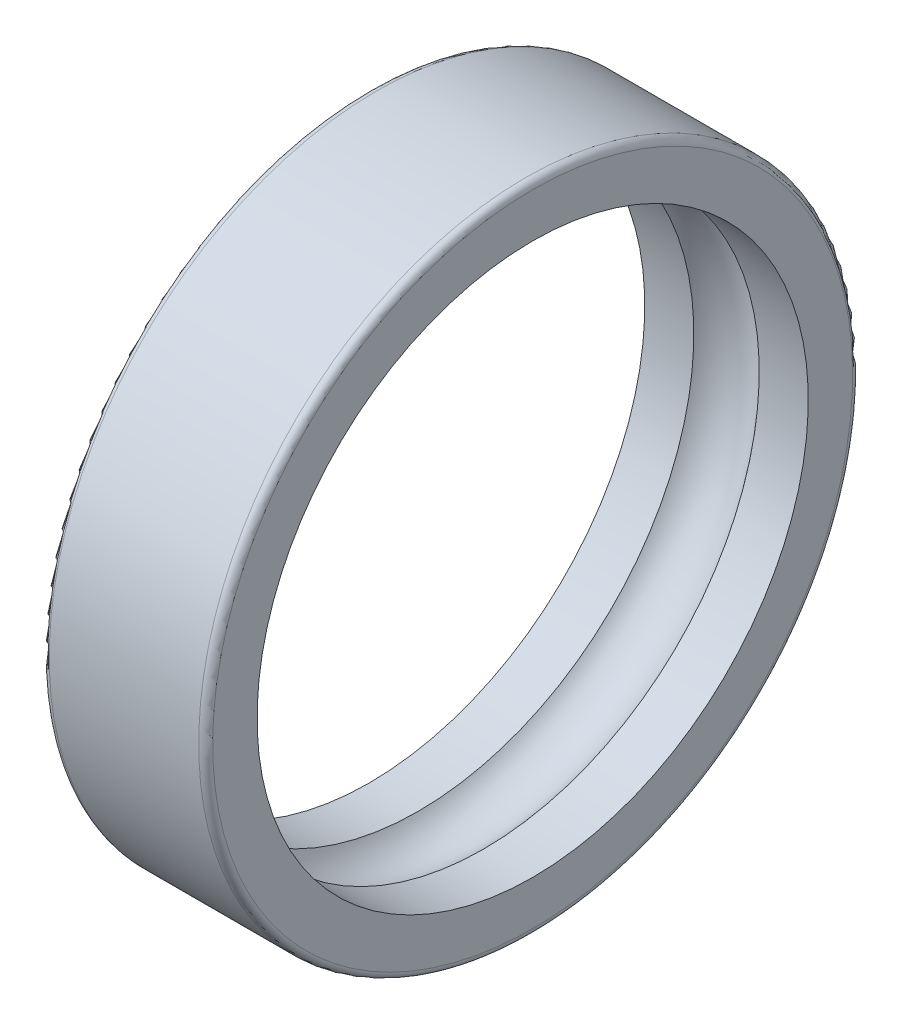
ISO-10303-21;
HEADER;
FILE_DESCRIPTION(('STEP AP214'),'2;1');
FILE_NAME('part.step','',(''),(''),'','','');
FILE_SCHEMA(('AUTOMOTIVE_DESIGN { 1 0 10303 214 1 1 1 1 }'));
ENDSEC;
DATA;
#1=APPLICATION_CONTEXT('core data for automotive mechanical design processes');
#2=APPLICATION_PROTOCOL_DEFINITION('international standard','automotive_design',2000,#1);
#3=PRODUCT_CONTEXT('',#1,'mechanical');
#4=PRODUCT('Part','Part','',(#3));
#5=PRODUCT_RELATED_PRODUCT_CATEGORY('part','',(#4));
#6=PRODUCT_DEFINITION_FORMATION('','',#4);
#7=PRODUCT_DEFINITION_CONTEXT('part definition',#1,'design');
#8=PRODUCT_DEFINITION('design','',#6,#7);
#9=PRODUCT_DEFINITION_SHAPE('','',#8);
#10=(LENGTH_UNIT() NAMED_UNIT(*) SI_UNIT(.MILLI.,.METRE.));
#11=(NAMED_UNIT(*) PLANE_ANGLE_UNIT() SI_UNIT($,.RADIAN.));
#12=(NAMED_UNIT(*) SI_UNIT($,.STERADIAN.) SOLID_ANGLE_UNIT());
#13=UNCERTAINTY_MEASURE_WITH_UNIT(LENGTH_MEASURE(1.E-05),#10,'distance_accuracy_value','');
#14=(GEOMETRIC_REPRESENTATION_CONTEXT(3) GLOBAL_UNCERTAINTY_ASSIGNED_CONTEXT((#13)) GLOBAL_UNIT_ASSIGNED_CONTEXT((#10,
#11,#12)) REPRESENTATION_CONTEXT('',''));
#15=CARTESIAN_POINT('',(0.,0.,0.));
#16=DIRECTION('',(0.,0.,1.));
#17=DIRECTION('',(1.,0.,0.));
#18=AXIS2_PLACEMENT_3D('',#15,#16,#17);
#19=CARTESIAN_POINT('',(3.5,0.,0.));
#20=DIRECTION('',(1.,0.,0.));
#21=DIRECTION('',(0.,0.,-1.));
#22=AXIS2_PLACEMENT_3D('',#19,#20,#21);
#23=TOROIDAL_SURFACE('',#22,10.75,1.75);
#24=CARTESIAN_POINT('',(2.1,0.,0.));
#25=DIRECTION('',(1.,0.,0.));
#26=DIRECTION('',(0.,1.,0.));
#27=AXIS2_PLACEMENT_3D('',#24,#25,#26);
#28=CIRCLE('',#27,11.8);
#29=CARTESIAN_POINT('',(2.1,11.8,0.));
#30=VERTEX_POINT('',#29);
#31=EDGE_CURVE('E27',#30,#30,#28,.T.);
#32=ORIENTED_EDGE('',*,*,#31,.F.);
#33=EDGE_LOOP('',(#32));
#34=FACE_BOUND('',#33,.T.);
#35=CARTESIAN_POINT('',(4.9,0.,0.));
#36=DIRECTION('',(1.,0.,0.));
#37=DIRECTION('',(0.,1.,0.));
#38=AXIS2_PLACEMENT_3D('',#35,#36,#37);
#39=CIRCLE('',#38,11.8);
#40=CARTESIAN_POINT('',(4.9,11.8,0.));
#41=VERTEX_POINT('',#40);
#42=EDGE_CURVE('E11',#41,#41,#39,.T.);
#43=ORIENTED_EDGE('',*,*,#42,.T.);
#44=EDGE_LOOP('',(#43));
#45=FACE_BOUND('',#44,.T.);
#46=ADVANCED_FACE('F17',(#34,#45),#23,.F.);
#47=CARTESIAN_POINT('',(1.05,0.,0.));
#48=DIRECTION('',(-1.,0.,0.));
#49=DIRECTION('',(0.,1.,0.));
#50=AXIS2_PLACEMENT_3D('',#47,#48,#49);
#51=CYLINDRICAL_SURFACE('',#50,11.8);
#52=CARTESIAN_POINT('',(0.,0.,0.));
#53=DIRECTION('',(1.,0.,0.));
#54=DIRECTION('',(0.,1.,0.));
#55=AXIS2_PLACEMENT_3D('',#52,#53,#54);
#56=CIRCLE('',#55,11.8);
#57=CARTESIAN_POINT('',(0.,11.8,0.));
#58=VERTEX_POINT('',#57);
#59=EDGE_CURVE('E79',#58,#58,#56,.T.);
#60=ORIENTED_EDGE('',*,*,#59,.F.);
#61=EDGE_LOOP('',(#60));
#62=FACE_BOUND('',#61,.T.);
#63=ORIENTED_EDGE('',*,*,#31,.T.);
#64=EDGE_LOOP('',(#63));
#65=FACE_BOUND('',#64,.T.);
#66=ADVANCED_FACE('F188',(#62,#65),#51,.F.);
#67=CARTESIAN_POINT('',(0.,12.75,0.));
#68=DIRECTION('',(-1.,0.,0.));
#69=DIRECTION('',(0.,-1.,0.));
#70=AXIS2_PLACEMENT_3D('',#67,#68,#69);
#71=PLANE('',#70);
#72=CARTESIAN_POINT('',(0.,0.,0.));
#73=DIRECTION('',(1.,0.,0.));
#74=DIRECTION('',(0.,1.,0.));
#75=AXIS2_PLACEMENT_3D('',#72,#73,#74);
#76=CIRCLE('',#75,13.7);
#77=CARTESIAN_POINT('',(0.,13.7,0.));
#78=VERTEX_POINT('',#77);
#79=EDGE_CURVE('E76',#78,#78,#76,.T.);
#80=ORIENTED_EDGE('',*,*,#79,.F.);
#81=EDGE_LOOP('',(#80));
#82=FACE_BOUND('',#81,.T.);
#83=ORIENTED_EDGE('',*,*,#59,.T.);
#84=EDGE_LOOP('',(#83));
#85=FACE_BOUND('',#84,.T.);
#86=ADVANCED_FACE('F19',(#82,#85),#71,.T.);
#87=CARTESIAN_POINT('',(0.3,0.,0.));
#88=DIRECTION('',(1.,0.,0.));
#89=DIRECTION('',(0.,0.,-1.));
#90=AXIS2_PLACEMENT_3D('',#87,#88,#89);
#91=TOROIDAL_SURFACE('',#90,13.7,0.3);
#92=CARTESIAN_POINT('',(0.3,0.,0.));
#93=DIRECTION('',(1.,0.,0.));
#94=DIRECTION('',(0.,1.,0.));
#95=AXIS2_PLACEMENT_3D('',#92,#93,#94);
#96=CIRCLE('',#95,14.);
#97=CARTESIAN_POINT('',(0.3,14.,0.));
#98=VERTEX_POINT('',#97);
#99=EDGE_CURVE('E80',#98,#98,#96,.T.);
#100=ORIENTED_EDGE('',*,*,#99,.F.);
#101=EDGE_LOOP('',(#100));
#102=FACE_BOUND('',#101,.T.);
#103=ORIENTED_EDGE('',*,*,#79,.T.);
#104=EDGE_LOOP('',(#103));
#105=FACE_BOUND('',#104,.T.);
#106=ADVANCED_FACE('F180',(#102,#105),#91,.T.);
#107=CARTESIAN_POINT('',(3.5,0.,0.));
#108=DIRECTION('',(-1.,0.,0.));
#109=DIRECTION('',(0.,1.,0.));
#110=AXIS2_PLACEMENT_3D('',#107,#108,#109);
#111=CYLINDRICAL_SURFACE('',#110,14.);
#112=CARTESIAN_POINT('',(6.7,0.,0.));
#113=DIRECTION('',(1.,0.,0.));
#114=DIRECTION('',(0.,1.,0.));
#115=AXIS2_PLACEMENT_3D('',#112,#113,#114);
#116=CIRCLE('',#115,14.);
#117=CARTESIAN_POINT('',(6.7,14.,0.));
#118=VERTEX_POINT('',#117);
#119=EDGE_CURVE('E85',#118,#118,#116,.T.);
#120=ORIENTED_EDGE('',*,*,#119,.F.);
#121=EDGE_LOOP('',(#120));
#122=FACE_BOUND('',#121,.T.);
#123=ORIENTED_EDGE('',*,*,#99,.T.);
#124=EDGE_LOOP('',(#123));
#125=FACE_BOUND('',#124,.T.);
#126=ADVANCED_FACE('F177',(#122,#125),#111,.T.);
#127=CARTESIAN_POINT('',(6.7,0.,0.));
#128=DIRECTION('',(1.,0.,0.));
#129=DIRECTION('',(0.,0.,-1.));
#130=AXIS2_PLACEMENT_3D('',#127,#128,#129);
#131=TOROIDAL_SURFACE('',#130,13.7,0.3);
#132=CARTESIAN_POINT('',(7.,0.,0.));
#133=DIRECTION('',(1.,0.,0.));
#134=DIRECTION('',(0.,1.,0.));
#135=AXIS2_PLACEMENT_3D('',#132,#133,#134);
#136=CIRCLE('',#135,13.7);
#137=CARTESIAN_POINT('',(7.,13.7,0.));
#138=VERTEX_POINT('',#137);
#139=EDGE_CURVE('E171',#138,#138,#136,.T.);
#140=ORIENTED_EDGE('',*,*,#139,.F.);
#141=EDGE_LOOP('',(#140));
#142=FACE_BOUND('',#141,.T.);
#143=ORIENTED_EDGE('',*,*,#119,.T.);
#144=EDGE_LOOP('',(#143));
#145=FACE_BOUND('',#144,.T.);
#146=ADVANCED_FACE('F145',(#142,#145),#131,.T.);
#147=CARTESIAN_POINT('',(7.,12.75,0.));
#148=DIRECTION('',(1.,0.,0.));
#149=DIRECTION('',(0.,1.,0.));
#150=AXIS2_PLACEMENT_3D('',#147,#148,#149);
#151=PLANE('',#150);
#152=CARTESIAN_POINT('',(7.,0.,0.));
#153=DIRECTION('',(1.,0.,0.));
#154=DIRECTION('',(0.,1.,0.));
#155=AXIS2_PLACEMENT_3D('',#152,#153,#154);
#156=CIRCLE('',#155,11.8);
#157=CARTESIAN_POINT('',(7.,11.8,0.));
#158=VERTEX_POINT('',#157);
#159=EDGE_CURVE('E88',#158,#158,#156,.T.);
#160=ORIENTED_EDGE('',*,*,#159,.F.);
#161=EDGE_LOOP('',(#160));
#162=FACE_BOUND('',#161,.T.);
#163=ORIENTED_EDGE('',*,*,#139,.T.);
#164=EDGE_LOOP('',(#163));
#165=FACE_BOUND('',#164,.T.);
#166=ADVANCED_FACE('F142',(#162,#165),#151,.T.);
#167=CARTESIAN_POINT('',(5.95,0.,0.));
#168=DIRECTION('',(-1.,0.,0.));
#169=DIRECTION('',(0.,1.,0.));
#170=AXIS2_PLACEMENT_3D('',#167,#168,#169);
#171=CYLINDRICAL_SURFACE('',#170,11.8);
#172=ORIENTED_EDGE('',*,*,#42,.F.);
#173=EDGE_LOOP('',(#172));
#174=FACE_BOUND('',#173,.T.);
#175=ORIENTED_EDGE('',*,*,#159,.T.);
#176=EDGE_LOOP('',(#175));
#177=FACE_BOUND('',#176,.T.);
#178=ADVANCED_FACE('F144',(#174,#177),#171,.F.);
#179=CLOSED_SHELL('',(#46,#66,#86,#106,#126,#146,#166,#178));
#180=CARTESIAN_POINT('',(0.735,0.,0.));
#181=DIRECTION('',(-1.,0.,0.));
#182=DIRECTION('',(0.,0.,-1.));
#183=AXIS2_PLACEMENT_3D('',#180,#181,#182);
#184=CYLINDRICAL_SURFACE('',#183,12.222);
#185=CARTESIAN_POINT('',(0.7,0.,0.));
#186=DIRECTION('',(-1.,0.,0.));
#187=DIRECTION('',(0.,0.,-1.));
#188=AXIS2_PLACEMENT_3D('',#185,#186,#187);
#189=CIRCLE('',#188,12.222);
#190=CARTESIAN_POINT('',(0.7,0.,12.222));
#191=VERTEX_POINT('',#190);
#192=EDGE_CURVE('E21',#191,#191,#189,.T.);
#193=ORIENTED_EDGE('',*,*,#192,.T.);
#194=EDGE_LOOP('',(#193));
#195=FACE_BOUND('',#194,.T.);
#196=CARTESIAN_POINT('',(0.14,0.,0.));
#197=DIRECTION('',(1.,0.,0.));
#198=DIRECTION('',(0.,0.,-1.));
#199=AXIS2_PLACEMENT_3D('',#196,#197,#198);
#200=CIRCLE('',#199,12.222);
#201=CARTESIAN_POINT('',(0.14,0.,12.222));
#202=VERTEX_POINT('',#201);
#203=EDGE_CURVE('E95',#202,#202,#200,.T.);
#204=ORIENTED_EDGE('',*,*,#203,.T.);
#205=EDGE_LOOP('',(#204));
#206=FACE_BOUND('',#205,.T.);
#207=ADVANCED_FACE('F141',(#195,#206),#184,.T.);
#208=CARTESIAN_POINT('',(0.42,0.,0.));
#209=DIRECTION('',(-1.,0.,0.));
#210=DIRECTION('',(0.,0.,-1.));
#211=AXIS2_PLACEMENT_3D('',#208,#209,#210);
#212=CYLINDRICAL_SURFACE('',#211,12.517);
#213=CARTESIAN_POINT('',(0.14,0.,0.));
#214=DIRECTION('',(-1.,0.,0.));
#215=DIRECTION('',(0.,0.,-1.));
#216=AXIS2_PLACEMENT_3D('',#213,#214,#215);
#217=CIRCLE('',#216,12.517);
#218=CARTESIAN_POINT('',(0.14,0.,-12.517));
#219=VERTEX_POINT('',#218);
#220=EDGE_CURVE('E91',#219,#219,#217,.T.);
#221=ORIENTED_EDGE('',*,*,#220,.T.);
#222=EDGE_LOOP('',(#221));
#223=FACE_BOUND('',#222,.T.);
#224=CARTESIAN_POINT('',(0.7,0.,0.));
#225=DIRECTION('',(1.,0.,0.));
#226=DIRECTION('',(0.,0.,-1.));
#227=AXIS2_PLACEMENT_3D('',#224,#225,#226);
#228=CIRCLE('',#227,12.517);
#229=CARTESIAN_POINT('',(0.7,0.,-12.517));
#230=VERTEX_POINT('',#229);
#231=EDGE_CURVE('E89',#230,#230,#228,.T.);
#232=ORIENTED_EDGE('',*,*,#231,.T.);
#233=EDGE_LOOP('',(#232));
#234=FACE_BOUND('',#233,.T.);
#235=ADVANCED_FACE('F150',(#223,#234),#212,.F.);
#236=CARTESIAN_POINT('',(0.14,0.,0.));
#237=DIRECTION('',(-1.,0.,0.));
#238=DIRECTION('',(0.,0.,1.));
#239=AXIS2_PLACEMENT_3D('',#236,#237,#238);
#240=PLANE('',#239);
#241=ORIENTED_EDGE('',*,*,#203,.F.);
#242=EDGE_LOOP('',(#241));
#243=FACE_BOUND('',#242,.T.);
#244=ORIENTED_EDGE('',*,*,#220,.F.);
#245=EDGE_LOOP('',(#244));
#246=FACE_BOUND('',#245,.T.);
#247=ADVANCED_FACE('F147',(#243,#246),#240,.F.);
#248=CARTESIAN_POINT('',(0.7,0.,0.));
#249=DIRECTION('',(1.,0.,0.));
#250=DIRECTION('',(0.,0.,-1.));
#251=AXIS2_PLACEMENT_3D('',#248,#249,#250);
#252=PLANE('',#251);
#253=ORIENTED_EDGE('',*,*,#192,.F.);
#254=EDGE_LOOP('',(#253));
#255=FACE_BOUND('',#254,.T.);
#256=ORIENTED_EDGE('',*,*,#231,.F.);
#257=EDGE_LOOP('',(#256));
#258=FACE_BOUND('',#257,.T.);
#259=ADVANCED_FACE('F149',(#255,#258),#252,.F.);
#260=CLOSED_SHELL('',(#207,#235,#247,#259));
#261=CARTESIAN_POINT('',(6.265,0.,0.));
#262=DIRECTION('',(1.,0.,0.));
#263=DIRECTION('',(0.,0.,1.));
#264=AXIS2_PLACEMENT_3D('',#261,#262,#263);
#265=CYLINDRICAL_SURFACE('',#264,12.222);
#266=CARTESIAN_POINT('',(6.3,0.,0.));
#267=DIRECTION('',(1.,0.,0.));
#268=DIRECTION('',(0.,0.,1.));
#269=AXIS2_PLACEMENT_3D('',#266,#267,#268);
#270=CIRCLE('',#269,12.222);
#271=CARTESIAN_POINT('',(6.3,0.,-12.222));
#272=VERTEX_POINT('',#271);
#273=EDGE_CURVE('E92',#272,#272,#270,.T.);
#274=ORIENTED_EDGE('',*,*,#273,.T.);
#275=EDGE_LOOP('',(#274));
#276=FACE_BOUND('',#275,.T.);
#277=CARTESIAN_POINT('',(6.86,0.,0.));
#278=DIRECTION('',(-1.,0.,0.));
#279=DIRECTION('',(0.,0.,1.));
#280=AXIS2_PLACEMENT_3D('',#277,#278,#279);
#281=CIRCLE('',#280,12.222);
#282=CARTESIAN_POINT('',(6.86,0.,-12.222));
#283=VERTEX_POINT('',#282);
#284=EDGE_CURVE('E98',#283,#283,#281,.T.);
#285=ORIENTED_EDGE('',*,*,#284,.T.);
#286=EDGE_LOOP('',(#285));
#287=FACE_BOUND('',#286,.T.);
#288=ADVANCED_FACE('F126',(#276,#287),#265,.T.);
#289=CARTESIAN_POINT('',(6.58,0.,0.));
#290=DIRECTION('',(1.,0.,0.));
#291=DIRECTION('',(0.,0.,1.));
#292=AXIS2_PLACEMENT_3D('',#289,#290,#291);
#293=CYLINDRICAL_SURFACE('',#292,12.517);
#294=CARTESIAN_POINT('',(6.86,0.,0.));
#295=DIRECTION('',(1.,0.,0.));
#296=DIRECTION('',(0.,0.,1.));
#297=AXIS2_PLACEMENT_3D('',#294,#295,#296);
#298=CIRCLE('',#297,12.517);
#299=CARTESIAN_POINT('',(6.86,0.,12.517));
#300=VERTEX_POINT('',#299);
#301=EDGE_CURVE('E102',#300,#300,#298,.T.);
#302=ORIENTED_EDGE('',*,*,#301,.T.);
#303=EDGE_LOOP('',(#302));
#304=FACE_BOUND('',#303,.T.);
#305=CARTESIAN_POINT('',(6.3,0.,0.));
#306=DIRECTION('',(-1.,0.,0.));
#307=DIRECTION('',(0.,0.,1.));
#308=AXIS2_PLACEMENT_3D('',#305,#306,#307);
#309=CIRCLE('',#308,12.517);
#310=CARTESIAN_POINT('',(6.3,0.,12.517));
#311=VERTEX_POINT('',#310);
#312=EDGE_CURVE('E107',#311,#311,#309,.T.);
#313=ORIENTED_EDGE('',*,*,#312,.T.);
#314=EDGE_LOOP('',(#313));
#315=FACE_BOUND('',#314,.T.);
#316=ADVANCED_FACE('F111',(#304,#315),#293,.F.);
#317=CARTESIAN_POINT('',(6.86,0.,0.));
#318=DIRECTION('',(1.,0.,0.));
#319=DIRECTION('',(0.,0.,-1.));
#320=AXIS2_PLACEMENT_3D('',#317,#318,#319);
#321=PLANE('',#320);
#322=ORIENTED_EDGE('',*,*,#284,.F.);
#323=EDGE_LOOP('',(#322));
#324=FACE_BOUND('',#323,.T.);
#325=ORIENTED_EDGE('',*,*,#301,.F.);
#326=EDGE_LOOP('',(#325));
#327=FACE_BOUND('',#326,.T.);
#328=ADVANCED_FACE('F115',(#324,#327),#321,.F.);
#329=CARTESIAN_POINT('',(6.3,0.,0.));
#330=DIRECTION('',(-1.,0.,0.));
#331=DIRECTION('',(0.,0.,1.));
#332=AXIS2_PLACEMENT_3D('',#329,#330,#331);
#333=PLANE('',#332);
#334=ORIENTED_EDGE('',*,*,#273,.F.);
#335=EDGE_LOOP('',(#334));
#336=FACE_BOUND('',#335,.T.);
#337=ORIENTED_EDGE('',*,*,#312,.F.);
#338=EDGE_LOOP('',(#337));
#339=FACE_BOUND('',#338,.T.);
#340=ADVANCED_FACE('F113',(#336,#339),#333,.F.);
#341=CLOSED_SHELL('',(#288,#316,#328,#340));
#342=ORIENTED_CLOSED_SHELL('',*,#179,.T.);
#343=ORIENTED_CLOSED_SHELL('',*,#341,.T.);
#344=BREP_WITH_VOIDS('B1',#260,(#342,#343));
#345=ADVANCED_BREP_SHAPE_REPRESENTATION('',(#18,#344),#14);
#346=SHAPE_DEFINITION_REPRESENTATION(#9,#345);
ENDSEC;
END-ISO-10303-21;
